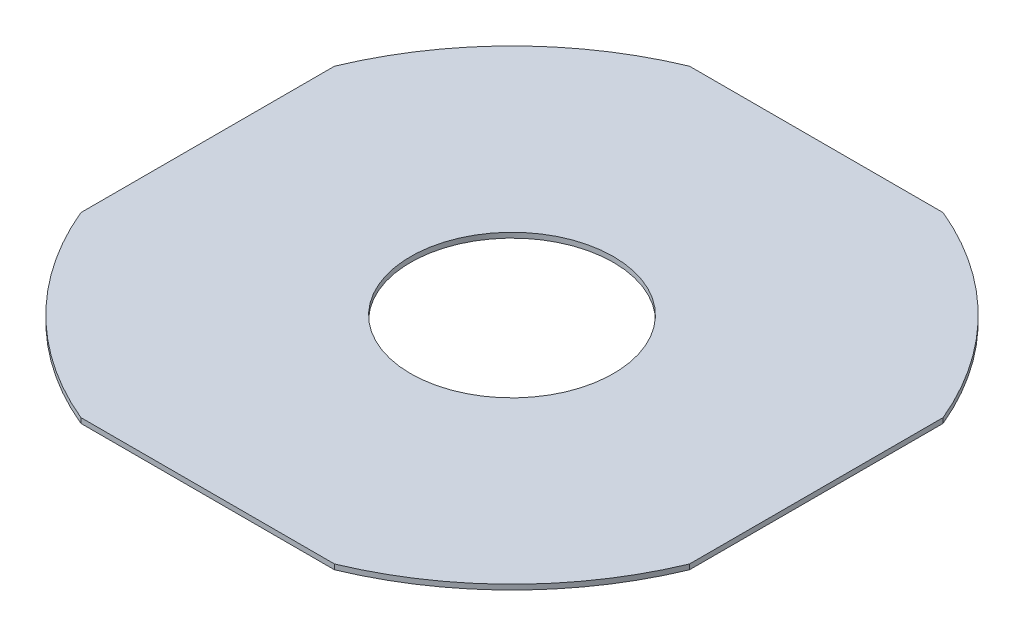
ISO-10303-21;
HEADER;
FILE_DESCRIPTION(('STEP AP214'),'2;1');
FILE_NAME('part.step','',(''),(''),'','','');
FILE_SCHEMA(('AUTOMOTIVE_DESIGN { 1 0 10303 214 1 1 1 1 }'));
ENDSEC;
DATA;
#1=APPLICATION_CONTEXT('core data for automotive mechanical design processes');
#2=APPLICATION_PROTOCOL_DEFINITION('international standard','automotive_design',2000,#1);
#3=PRODUCT_CONTEXT('',#1,'mechanical');
#4=PRODUCT('Part','Part','',(#3));
#5=PRODUCT_RELATED_PRODUCT_CATEGORY('part','',(#4));
#6=PRODUCT_DEFINITION_FORMATION('','',#4);
#7=PRODUCT_DEFINITION_CONTEXT('part definition',#1,'design');
#8=PRODUCT_DEFINITION('design','',#6,#7);
#9=PRODUCT_DEFINITION_SHAPE('','',#8);
#10=(LENGTH_UNIT() NAMED_UNIT(*) SI_UNIT(.MILLI.,.METRE.));
#11=(NAMED_UNIT(*) PLANE_ANGLE_UNIT() SI_UNIT($,.RADIAN.));
#12=(NAMED_UNIT(*) SI_UNIT($,.STERADIAN.) SOLID_ANGLE_UNIT());
#13=UNCERTAINTY_MEASURE_WITH_UNIT(LENGTH_MEASURE(1.E-05),#10,'distance_accuracy_value','');
#14=(GEOMETRIC_REPRESENTATION_CONTEXT(3) GLOBAL_UNCERTAINTY_ASSIGNED_CONTEXT((#13)) GLOBAL_UNIT_ASSIGNED_CONTEXT((#10,
#11,#12)) REPRESENTATION_CONTEXT('',''));
#15=CARTESIAN_POINT('',(0.,0.,0.));
#16=DIRECTION('',(0.,0.,1.));
#17=DIRECTION('',(1.,0.,0.));
#18=AXIS2_PLACEMENT_3D('',#15,#16,#17);
#19=CARTESIAN_POINT('',(600.,10.,600.));
#20=DIRECTION('',(-1.,0.,0.));
#21=DIRECTION('',(0.,0.,1.));
#22=AXIS2_PLACEMENT_3D('',#19,#20,#21);
#23=PLANE('',#22);
#24=DIRECTION('',(0.,1.,0.));
#25=VECTOR('',#24,1.);
#26=CARTESIAN_POINT('',(600.,0.,250.));
#27=LINE('',#26,#25);
#28=CARTESIAN_POINT('',(600.,0.,250.));
#29=VERTEX_POINT('',#28);
#30=CARTESIAN_POINT('',(600.,10.,250.));
#31=VERTEX_POINT('',#30);
#32=EDGE_CURVE('E104',#29,#31,#27,.T.);
#33=ORIENTED_EDGE('',*,*,#32,.F.);
#34=DIRECTION('',(0.,0.,-1.));
#35=VECTOR('',#34,1.);
#36=CARTESIAN_POINT('',(600.,0.,600.));
#37=LINE('',#36,#35);
#38=CARTESIAN_POINT('',(600.,0.,-250.));
#39=VERTEX_POINT('',#38);
#40=EDGE_CURVE('E118',#29,#39,#37,.T.);
#41=ORIENTED_EDGE('',*,*,#40,.T.);
#42=DIRECTION('',(0.,1.,0.));
#43=VECTOR('',#42,1.);
#44=CARTESIAN_POINT('',(600.,0.,-250.));
#45=LINE('',#44,#43);
#46=CARTESIAN_POINT('',(600.,10.,-250.));
#47=VERTEX_POINT('',#46);
#48=EDGE_CURVE('E122',#47,#39,#45,.F.);
#49=ORIENTED_EDGE('',*,*,#48,.F.);
#50=DIRECTION('',(0.,0.,-1.));
#51=VECTOR('',#50,1.);
#52=CARTESIAN_POINT('',(600.,10.,600.));
#53=LINE('',#52,#51);
#54=EDGE_CURVE('E120',#31,#47,#53,.T.);
#55=ORIENTED_EDGE('',*,*,#54,.F.);
#56=EDGE_LOOP('',(#33,#41,#49,#55));
#57=FACE_BOUND('',#56,.T.);
#58=ADVANCED_FACE('F37',(#57),#23,.F.);
#59=CARTESIAN_POINT('',(-600.,10.,-600.));
#60=DIRECTION('',(0.,0.,1.));
#61=DIRECTION('',(1.,0.,0.));
#62=AXIS2_PLACEMENT_3D('',#59,#60,#61);
#63=PLANE('',#62);
#64=DIRECTION('',(0.,1.,0.));
#65=VECTOR('',#64,1.);
#66=CARTESIAN_POINT('',(250.,0.,-600.));
#67=LINE('',#66,#65);
#68=CARTESIAN_POINT('',(250.,0.,-600.));
#69=VERTEX_POINT('',#68);
#70=CARTESIAN_POINT('',(250.,10.,-600.));
#71=VERTEX_POINT('',#70);
#72=EDGE_CURVE('E162',#69,#71,#67,.T.);
#73=ORIENTED_EDGE('',*,*,#72,.F.);
#74=DIRECTION('',(-1.,0.,0.));
#75=VECTOR('',#74,1.);
#76=CARTESIAN_POINT('',(-600.,0.,-600.));
#77=LINE('',#76,#75);
#78=CARTESIAN_POINT('',(-250.,0.,-600.));
#79=VERTEX_POINT('',#78);
#80=EDGE_CURVE('E126',#69,#79,#77,.T.);
#81=ORIENTED_EDGE('',*,*,#80,.T.);
#82=DIRECTION('',(0.,1.,0.));
#83=VECTOR('',#82,1.);
#84=CARTESIAN_POINT('',(-250.,0.,-600.));
#85=LINE('',#84,#83);
#86=CARTESIAN_POINT('',(-250.,10.,-600.));
#87=VERTEX_POINT('',#86);
#88=EDGE_CURVE('E52',#87,#79,#85,.F.);
#89=ORIENTED_EDGE('',*,*,#88,.F.);
#90=DIRECTION('',(-1.,0.,0.));
#91=VECTOR('',#90,1.);
#92=CARTESIAN_POINT('',(-600.,10.,-600.));
#93=LINE('',#92,#91);
#94=EDGE_CURVE('E142',#71,#87,#93,.T.);
#95=ORIENTED_EDGE('',*,*,#94,.F.);
#96=EDGE_LOOP('',(#73,#81,#89,#95));
#97=FACE_BOUND('',#96,.T.);
#98=ADVANCED_FACE('F189',(#97),#63,.F.);
#99=CARTESIAN_POINT('',(-600.,10.,600.));
#100=DIRECTION('',(1.,0.,0.));
#101=DIRECTION('',(0.,0.,-1.));
#102=AXIS2_PLACEMENT_3D('',#99,#100,#101);
#103=PLANE('',#102);
#104=DIRECTION('',(0.,1.,0.));
#105=VECTOR('',#104,1.);
#106=CARTESIAN_POINT('',(-600.,0.,-250.));
#107=LINE('',#106,#105);
#108=CARTESIAN_POINT('',(-600.,0.,-250.));
#109=VERTEX_POINT('',#108);
#110=CARTESIAN_POINT('',(-600.,10.,-250.));
#111=VERTEX_POINT('',#110);
#112=EDGE_CURVE('E160',#109,#111,#107,.T.);
#113=ORIENTED_EDGE('',*,*,#112,.F.);
#114=DIRECTION('',(0.,0.,1.));
#115=VECTOR('',#114,1.);
#116=CARTESIAN_POINT('',(-600.,0.,600.));
#117=LINE('',#116,#115);
#118=CARTESIAN_POINT('',(-600.,0.,250.));
#119=VERTEX_POINT('',#118);
#120=EDGE_CURVE('E130',#109,#119,#117,.T.);
#121=ORIENTED_EDGE('',*,*,#120,.T.);
#122=DIRECTION('',(0.,1.,0.));
#123=VECTOR('',#122,1.);
#124=CARTESIAN_POINT('',(-600.,0.,250.));
#125=LINE('',#124,#123);
#126=CARTESIAN_POINT('',(-600.,10.,250.));
#127=VERTEX_POINT('',#126);
#128=EDGE_CURVE('E60',#127,#119,#125,.F.);
#129=ORIENTED_EDGE('',*,*,#128,.F.);
#130=DIRECTION('',(0.,0.,1.));
#131=VECTOR('',#130,1.);
#132=CARTESIAN_POINT('',(-600.,10.,600.));
#133=LINE('',#132,#131);
#134=EDGE_CURVE('E147',#111,#127,#133,.T.);
#135=ORIENTED_EDGE('',*,*,#134,.F.);
#136=EDGE_LOOP('',(#113,#121,#129,#135));
#137=FACE_BOUND('',#136,.T.);
#138=ADVANCED_FACE('F159',(#137),#103,.F.);
#139=CARTESIAN_POINT('',(-600.,10.,600.));
#140=DIRECTION('',(0.,0.,-1.));
#141=DIRECTION('',(-1.,0.,0.));
#142=AXIS2_PLACEMENT_3D('',#139,#140,#141);
#143=PLANE('',#142);
#144=DIRECTION('',(0.,1.,0.));
#145=VECTOR('',#144,1.);
#146=CARTESIAN_POINT('',(-250.,0.,600.));
#147=LINE('',#146,#145);
#148=CARTESIAN_POINT('',(-250.,0.,600.));
#149=VERTEX_POINT('',#148);
#150=CARTESIAN_POINT('',(-250.,10.,600.));
#151=VERTEX_POINT('',#150);
#152=EDGE_CURVE('E164',#149,#151,#147,.T.);
#153=ORIENTED_EDGE('',*,*,#152,.F.);
#154=DIRECTION('',(1.,0.,0.));
#155=VECTOR('',#154,1.);
#156=CARTESIAN_POINT('',(-600.,0.,600.));
#157=LINE('',#156,#155);
#158=CARTESIAN_POINT('',(250.,0.,600.));
#159=VERTEX_POINT('',#158);
#160=EDGE_CURVE('E139',#149,#159,#157,.T.);
#161=ORIENTED_EDGE('',*,*,#160,.T.);
#162=DIRECTION('',(0.,1.,0.));
#163=VECTOR('',#162,1.);
#164=CARTESIAN_POINT('',(250.,0.,600.));
#165=LINE('',#164,#163);
#166=CARTESIAN_POINT('',(250.,10.,600.));
#167=VERTEX_POINT('',#166);
#168=EDGE_CURVE('E107',#167,#159,#165,.F.);
#169=ORIENTED_EDGE('',*,*,#168,.F.);
#170=DIRECTION('',(1.,0.,0.));
#171=VECTOR('',#170,1.);
#172=CARTESIAN_POINT('',(-600.,10.,600.));
#173=LINE('',#172,#171);
#174=EDGE_CURVE('E135',#151,#167,#173,.T.);
#175=ORIENTED_EDGE('',*,*,#174,.F.);
#176=EDGE_LOOP('',(#153,#161,#169,#175));
#177=FACE_BOUND('',#176,.T.);
#178=ADVANCED_FACE('F180',(#177),#143,.F.);
#179=CARTESIAN_POINT('',(0.,10.,0.));
#180=DIRECTION('',(0.,-1.,0.));
#181=DIRECTION('',(0.,0.,-1.));
#182=AXIS2_PLACEMENT_3D('',#179,#180,#181);
#183=PLANE('',#182);
#184=CARTESIAN_POINT('',(0.,10.,0.));
#185=DIRECTION('',(0.,1.,0.));
#186=DIRECTION('',(0.,0.,1.));
#187=AXIS2_PLACEMENT_3D('',#184,#185,#186);
#188=CIRCLE('',#187,200.);
#189=CARTESIAN_POINT('',(0.,10.,200.));
#190=VERTEX_POINT('',#189);
#191=EDGE_CURVE('E121',#190,#190,#188,.T.);
#192=ORIENTED_EDGE('',*,*,#191,.F.);
#193=EDGE_LOOP('',(#192));
#194=FACE_BOUND('',#193,.T.);
#195=CARTESIAN_POINT('',(0.,10.,0.));
#196=DIRECTION('',(0.,1.,0.));
#197=DIRECTION('',(0.,0.,1.));
#198=AXIS2_PLACEMENT_3D('',#195,#196,#197);
#199=CIRCLE('',#198,650.);
#200=EDGE_CURVE('E172',#47,#71,#199,.T.);
#201=ORIENTED_EDGE('',*,*,#200,.T.);
#202=ORIENTED_EDGE('',*,*,#94,.T.);
#203=EDGE_CURVE('E174',#87,#111,#199,.T.);
#204=ORIENTED_EDGE('',*,*,#203,.T.);
#205=ORIENTED_EDGE('',*,*,#134,.T.);
#206=EDGE_CURVE('E176',#127,#151,#199,.T.);
#207=ORIENTED_EDGE('',*,*,#206,.T.);
#208=ORIENTED_EDGE('',*,*,#174,.T.);
#209=EDGE_CURVE('E112',#167,#31,#199,.T.);
#210=ORIENTED_EDGE('',*,*,#209,.T.);
#211=ORIENTED_EDGE('',*,*,#54,.T.);
#212=EDGE_LOOP('',(#201,#202,#204,#205,#207,#208,#210,#211));
#213=FACE_BOUND('',#212,.T.);
#214=ADVANCED_FACE('F179',(#194,#213),#183,.F.);
#215=CARTESIAN_POINT('',(0.,0.,0.));
#216=DIRECTION('',(0.,-1.,0.));
#217=DIRECTION('',(0.,0.,-1.));
#218=AXIS2_PLACEMENT_3D('',#215,#216,#217);
#219=PLANE('',#218);
#220=CARTESIAN_POINT('',(0.,0.,0.));
#221=DIRECTION('',(0.,1.,0.));
#222=DIRECTION('',(0.,0.,1.));
#223=AXIS2_PLACEMENT_3D('',#220,#221,#222);
#224=CIRCLE('',#223,200.);
#225=CARTESIAN_POINT('',(0.,0.,200.));
#226=VERTEX_POINT('',#225);
#227=EDGE_CURVE('E127',#226,#226,#224,.T.);
#228=ORIENTED_EDGE('',*,*,#227,.T.);
#229=EDGE_LOOP('',(#228));
#230=FACE_BOUND('',#229,.T.);
#231=ORIENTED_EDGE('',*,*,#80,.F.);
#232=CARTESIAN_POINT('',(0.,0.,0.));
#233=DIRECTION('',(0.,-1.,0.));
#234=DIRECTION('',(0.,0.,-1.));
#235=AXIS2_PLACEMENT_3D('',#232,#233,#234);
#236=CIRCLE('',#235,650.);
#237=EDGE_CURVE('E11',#69,#39,#236,.T.);
#238=ORIENTED_EDGE('',*,*,#237,.T.);
#239=ORIENTED_EDGE('',*,*,#40,.F.);
#240=CARTESIAN_POINT('',(0.,0.,0.));
#241=DIRECTION('',(0.,1.,0.));
#242=DIRECTION('',(0.,0.,1.));
#243=AXIS2_PLACEMENT_3D('',#240,#241,#242);
#244=CIRCLE('',#243,650.);
#245=EDGE_CURVE('E101',#159,#29,#244,.T.);
#246=ORIENTED_EDGE('',*,*,#245,.F.);
#247=ORIENTED_EDGE('',*,*,#160,.F.);
#248=EDGE_CURVE('E45',#149,#119,#236,.T.);
#249=ORIENTED_EDGE('',*,*,#248,.T.);
#250=ORIENTED_EDGE('',*,*,#120,.F.);
#251=EDGE_CURVE('E40',#109,#79,#236,.T.);
#252=ORIENTED_EDGE('',*,*,#251,.T.);
#253=EDGE_LOOP('',(#231,#238,#239,#246,#247,#249,#250,#252));
#254=FACE_BOUND('',#253,.T.);
#255=ADVANCED_FACE('F125',(#230,#254),#219,.T.);
#256=CARTESIAN_POINT('',(0.,0.,0.));
#257=DIRECTION('',(0.,1.,0.));
#258=DIRECTION('',(0.,0.,1.));
#259=AXIS2_PLACEMENT_3D('',#256,#257,#258);
#260=CYLINDRICAL_SURFACE('',#259,200.);
#261=ORIENTED_EDGE('',*,*,#227,.F.);
#262=EDGE_LOOP('',(#261));
#263=FACE_BOUND('',#262,.T.);
#264=ORIENTED_EDGE('',*,*,#191,.T.);
#265=EDGE_LOOP('',(#264));
#266=FACE_BOUND('',#265,.T.);
#267=ADVANCED_FACE('F202',(#263,#266),#260,.F.);
#268=CARTESIAN_POINT('',(0.,0.,0.));
#269=DIRECTION('',(0.,1.,0.));
#270=DIRECTION('',(0.,0.,1.));
#271=AXIS2_PLACEMENT_3D('',#268,#269,#270);
#272=CYLINDRICAL_SURFACE('',#271,650.);
#273=ORIENTED_EDGE('',*,*,#88,.T.);
#274=ORIENTED_EDGE('',*,*,#251,.F.);
#275=ORIENTED_EDGE('',*,*,#112,.T.);
#276=ORIENTED_EDGE('',*,*,#203,.F.);
#277=EDGE_LOOP('',(#273,#274,#275,#276));
#278=FACE_BOUND('',#277,.T.);
#279=ADVANCED_FACE('F200',(#278),#272,.T.);
#280=ORIENTED_EDGE('',*,*,#128,.T.);
#281=ORIENTED_EDGE('',*,*,#248,.F.);
#282=ORIENTED_EDGE('',*,*,#152,.T.);
#283=ORIENTED_EDGE('',*,*,#206,.F.);
#284=EDGE_LOOP('',(#280,#281,#282,#283));
#285=FACE_BOUND('',#284,.T.);
#286=ADVANCED_FACE('F178',(#285),#272,.T.);
#287=ORIENTED_EDGE('',*,*,#32,.T.);
#288=ORIENTED_EDGE('',*,*,#209,.F.);
#289=ORIENTED_EDGE('',*,*,#168,.T.);
#290=ORIENTED_EDGE('',*,*,#245,.T.);
#291=EDGE_LOOP('',(#287,#288,#289,#290));
#292=FACE_BOUND('',#291,.T.);
#293=ADVANCED_FACE('F103',(#292),#272,.T.);
#294=ORIENTED_EDGE('',*,*,#48,.T.);
#295=ORIENTED_EDGE('',*,*,#237,.F.);
#296=ORIENTED_EDGE('',*,*,#72,.T.);
#297=ORIENTED_EDGE('',*,*,#200,.F.);
#298=EDGE_LOOP('',(#294,#295,#296,#297));
#299=FACE_BOUND('',#298,.T.);
#300=ADVANCED_FACE('F170',(#299),#272,.T.);
#301=CLOSED_SHELL('',(#58,#98,#138,#178,#214,#255,#267,#279,#286,#293,#300));
#302=MANIFOLD_SOLID_BREP('B2',#301);
#303=ADVANCED_BREP_SHAPE_REPRESENTATION('',(#18,#302),#14);
#304=SHAPE_DEFINITION_REPRESENTATION(#9,#303);
ENDSEC;
END-ISO-10303-21;
